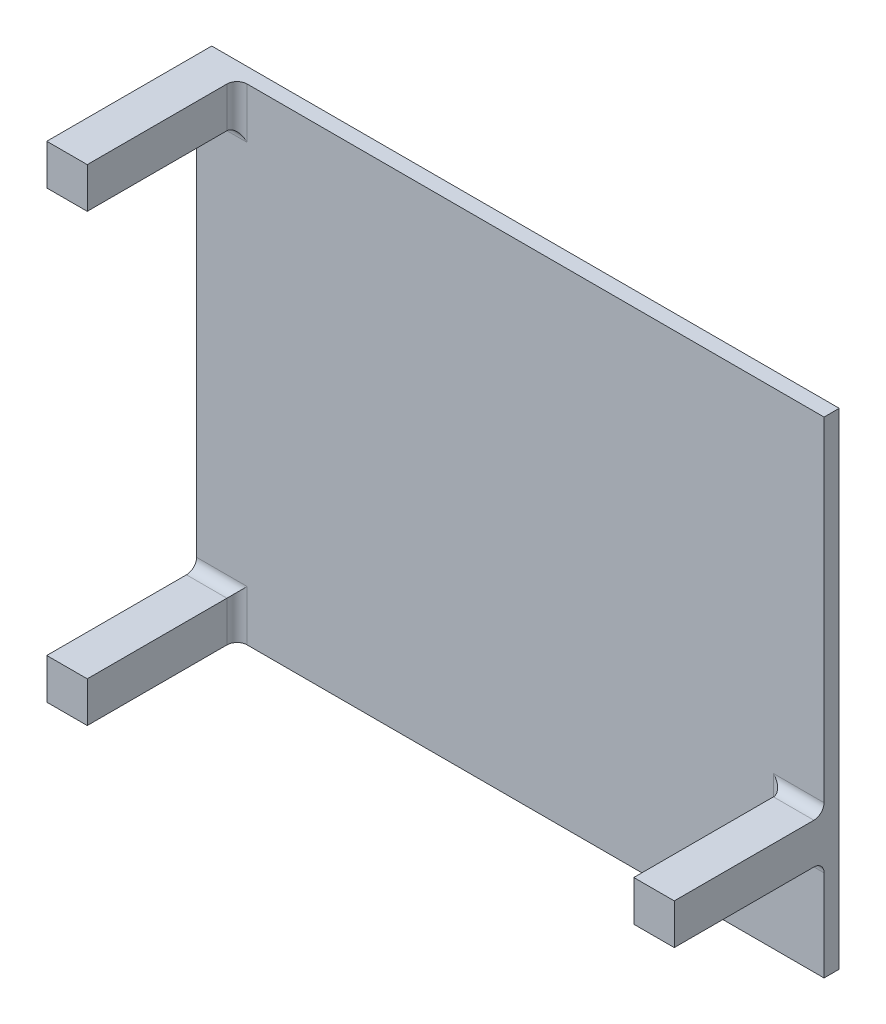
ISO-10303-21;
HEADER;
FILE_DESCRIPTION(('STEP AP214'),'2;1');
FILE_NAME('part.step','',(''),(''),'','','');
FILE_SCHEMA(('AUTOMOTIVE_DESIGN { 1 0 10303 214 1 1 1 1 }'));
ENDSEC;
DATA;
#1=APPLICATION_CONTEXT('core data for automotive mechanical design processes');
#2=APPLICATION_PROTOCOL_DEFINITION('international standard','automotive_design',2000,#1);
#3=PRODUCT_CONTEXT('',#1,'mechanical');
#4=PRODUCT('Part','Part','',(#3));
#5=PRODUCT_RELATED_PRODUCT_CATEGORY('part','',(#4));
#6=PRODUCT_DEFINITION_FORMATION('','',#4);
#7=PRODUCT_DEFINITION_CONTEXT('part definition',#1,'design');
#8=PRODUCT_DEFINITION('design','',#6,#7);
#9=PRODUCT_DEFINITION_SHAPE('','',#8);
#10=(LENGTH_UNIT() NAMED_UNIT(*) SI_UNIT(.MILLI.,.METRE.));
#11=(NAMED_UNIT(*) PLANE_ANGLE_UNIT() SI_UNIT($,.RADIAN.));
#12=(NAMED_UNIT(*) SI_UNIT($,.STERADIAN.) SOLID_ANGLE_UNIT());
#13=UNCERTAINTY_MEASURE_WITH_UNIT(LENGTH_MEASURE(1.E-05),#10,'distance_accuracy_value','');
#14=(GEOMETRIC_REPRESENTATION_CONTEXT(3) GLOBAL_UNCERTAINTY_ASSIGNED_CONTEXT((#13)) GLOBAL_UNIT_ASSIGNED_CONTEXT((#10,
#11,#12)) REPRESENTATION_CONTEXT('',''));
#15=CARTESIAN_POINT('',(0.,0.,0.));
#16=DIRECTION('',(0.,0.,1.));
#17=DIRECTION('',(1.,0.,0.));
#18=AXIS2_PLACEMENT_3D('',#15,#16,#17);
#19=CARTESIAN_POINT('',(0.,0.,1.5));
#20=DIRECTION('',(0.,0.,1.));
#21=DIRECTION('',(1.,0.,0.));
#22=AXIS2_PLACEMENT_3D('',#19,#20,#21);
#23=PLANE('',#22);
#24=DIRECTION('',(0.,-1.,0.));
#25=VECTOR('',#24,1.);
#26=CARTESIAN_POINT('',(17.5663865007572,0.,1.5));
#27=LINE('',#26,#25);
#28=CARTESIAN_POINT('',(17.5663865007572,-9.92335766423358,1.5));
#29=VERTEX_POINT('',#28);
#30=CARTESIAN_POINT('',(17.5663865007572,-3.92335766423359,1.5));
#31=VERTEX_POINT('',#30);
#32=EDGE_CURVE('E279',#29,#31,#27,.F.);
#33=ORIENTED_EDGE('',*,*,#32,.T.);
#34=DIRECTION('',(-1.,0.,0.));
#35=VECTOR('',#34,1.);
#36=CARTESIAN_POINT('',(0.,-3.92335766423359,1.5));
#37=LINE('',#36,#35);
#38=CARTESIAN_POINT('',(22.5663865007572,-3.92335766423359,1.5));
#39=VERTEX_POINT('',#38);
#40=EDGE_CURVE('E281',#31,#39,#37,.F.);
#41=ORIENTED_EDGE('',*,*,#40,.T.);
#42=DIRECTION('',(0.,1.,0.));
#43=VECTOR('',#42,1.);
#44=CARTESIAN_POINT('',(22.5663865007572,29.0766423357664,1.5));
#45=LINE('',#44,#43);
#46=CARTESIAN_POINT('',(22.5663865007572,29.0766423357664,1.5));
#47=VERTEX_POINT('',#46);
#48=EDGE_CURVE('E241',#39,#47,#45,.T.);
#49=ORIENTED_EDGE('',*,*,#48,.T.);
#50=DIRECTION('',(-1.,0.,0.));
#51=VECTOR('',#50,1.);
#52=CARTESIAN_POINT('',(-39.4336134992428,29.0766423357664,1.5));
#53=LINE('',#52,#51);
#54=CARTESIAN_POINT('',(-34.4336134992428,29.0766423357664,1.5));
#55=VERTEX_POINT('',#54);
#56=EDGE_CURVE('E245',#47,#55,#53,.T.);
#57=ORIENTED_EDGE('',*,*,#56,.T.);
#58=DIRECTION('',(0.,1.,0.));
#59=VECTOR('',#58,1.);
#60=CARTESIAN_POINT('',(-34.4336134992428,0.,1.5));
#61=LINE('',#60,#59);
#62=CARTESIAN_POINT('',(-34.4336134992428,24.0766423357664,1.5));
#63=VERTEX_POINT('',#62);
#64=EDGE_CURVE('E273',#55,#63,#61,.F.);
#65=ORIENTED_EDGE('',*,*,#64,.T.);
#66=DIRECTION('',(1.,0.,0.));
#67=VECTOR('',#66,1.);
#68=CARTESIAN_POINT('',(0.,24.0766423357664,1.5));
#69=LINE('',#68,#67);
#70=CARTESIAN_POINT('',(-39.4336134992428,24.0766423357664,1.5));
#71=VERTEX_POINT('',#70);
#72=EDGE_CURVE('E275',#63,#71,#69,.F.);
#73=ORIENTED_EDGE('',*,*,#72,.T.);
#74=DIRECTION('',(0.,-1.,0.));
#75=VECTOR('',#74,1.);
#76=CARTESIAN_POINT('',(-39.4336134992428,29.0766423357664,1.5));
#77=LINE('',#76,#75);
#78=CARTESIAN_POINT('',(-39.4336134992428,-13.9233576642336,1.5));
#79=VERTEX_POINT('',#78);
#80=EDGE_CURVE('E235',#71,#79,#77,.T.);
#81=ORIENTED_EDGE('',*,*,#80,.T.);
#82=DIRECTION('',(-1.,0.,0.));
#83=VECTOR('',#82,1.);
#84=CARTESIAN_POINT('',(0.,-13.9233576642336,1.5));
#85=LINE('',#84,#83);
#86=CARTESIAN_POINT('',(-34.4336134992428,-13.9233576642336,1.5));
#87=VERTEX_POINT('',#86);
#88=EDGE_CURVE('E269',#79,#87,#85,.F.);
#89=ORIENTED_EDGE('',*,*,#88,.T.);
#90=DIRECTION('',(0.,1.,0.));
#91=VECTOR('',#90,1.);
#92=CARTESIAN_POINT('',(-34.4336134992428,0.,1.5));
#93=LINE('',#92,#91);
#94=CARTESIAN_POINT('',(-34.4336134992428,-18.9233576642336,1.5));
#95=VERTEX_POINT('',#94);
#96=EDGE_CURVE('E271',#87,#95,#93,.F.);
#97=ORIENTED_EDGE('',*,*,#96,.T.);
#98=DIRECTION('',(1.,0.,0.));
#99=VECTOR('',#98,1.);
#100=CARTESIAN_POINT('',(-39.4336134992428,-18.9233576642336,1.5));
#101=LINE('',#100,#99);
#102=CARTESIAN_POINT('',(22.5663865007572,-18.9233576642336,1.5));
#103=VERTEX_POINT('',#102);
#104=EDGE_CURVE('E238',#95,#103,#101,.T.);
#105=ORIENTED_EDGE('',*,*,#104,.T.);
#106=CARTESIAN_POINT('',(22.5663865007572,-9.92335766423358,1.5));
#107=VERTEX_POINT('',#106);
#108=EDGE_CURVE('E242',#103,#107,#45,.T.);
#109=ORIENTED_EDGE('',*,*,#108,.T.);
#110=DIRECTION('',(1.,0.,0.));
#111=VECTOR('',#110,1.);
#112=CARTESIAN_POINT('',(0.,-9.92335766423358,1.5));
#113=LINE('',#112,#111);
#114=EDGE_CURVE('E277',#107,#29,#113,.F.);
#115=ORIENTED_EDGE('',*,*,#114,.T.);
#116=EDGE_LOOP('',(#33,#41,#49,#57,#65,#73,#81,#89,#97,#105,#109,#115));
#117=FACE_BOUND('',#116,.T.);
#118=ADVANCED_FACE('F33',(#117),#23,.T.);
#119=CARTESIAN_POINT('',(-39.4336134992428,29.0766423357664,1.5));
#120=DIRECTION('',(1.,0.,0.));
#121=DIRECTION('',(0.,1.,0.));
#122=AXIS2_PLACEMENT_3D('',#119,#120,#121);
#123=PLANE('',#122);
#124=DIRECTION('',(0.,-1.,0.));
#125=VECTOR('',#124,1.);
#126=CARTESIAN_POINT('',(-39.4336134992428,29.0766423357664,0.));
#127=LINE('',#126,#125);
#128=CARTESIAN_POINT('',(-39.4336134992428,29.0766423357664,0.));
#129=VERTEX_POINT('',#128);
#130=CARTESIAN_POINT('',(-39.4336134992428,-18.9233576642336,0.));
#131=VERTEX_POINT('',#130);
#132=EDGE_CURVE('E234',#129,#131,#127,.T.);
#133=ORIENTED_EDGE('',*,*,#132,.T.);
#134=DIRECTION('',(0.,0.,-1.));
#135=VECTOR('',#134,1.);
#136=CARTESIAN_POINT('',(-39.4336134992428,-18.9233576642336,1.5));
#137=LINE('',#136,#135);
#138=CARTESIAN_POINT('',(-39.4336134992428,-18.9233576642336,16.3));
#139=VERTEX_POINT('',#138);
#140=EDGE_CURVE('E264',#139,#131,#137,.T.);
#141=ORIENTED_EDGE('',*,*,#140,.F.);
#142=DIRECTION('',(0.,-1.,0.));
#143=VECTOR('',#142,1.);
#144=CARTESIAN_POINT('',(-39.4336134992428,-14.9233576642336,16.3));
#145=LINE('',#144,#143);
#146=CARTESIAN_POINT('',(-39.4336134992428,-14.9233576642336,16.3));
#147=VERTEX_POINT('',#146);
#148=EDGE_CURVE('E195',#147,#139,#145,.T.);
#149=ORIENTED_EDGE('',*,*,#148,.F.);
#150=DIRECTION('',(0.,0.,-1.));
#151=VECTOR('',#150,1.);
#152=CARTESIAN_POINT('',(-39.4336134992428,-14.9233576642336,16.3));
#153=LINE('',#152,#151);
#154=CARTESIAN_POINT('',(-39.4336134992428,-14.9233576642336,2.5));
#155=VERTEX_POINT('',#154);
#156=EDGE_CURVE('E209',#147,#155,#153,.T.);
#157=ORIENTED_EDGE('',*,*,#156,.T.);
#158=CARTESIAN_POINT('',(-39.4336134992428,-13.9233576642336,2.5));
#159=DIRECTION('',(1.,0.,0.));
#160=DIRECTION('',(0.,1.,0.));
#161=AXIS2_PLACEMENT_3D('',#158,#159,#160);
#162=CIRCLE('',#161,1.);
#163=EDGE_CURVE('E11',#155,#79,#162,.T.);
#164=ORIENTED_EDGE('',*,*,#163,.T.);
#165=ORIENTED_EDGE('',*,*,#80,.F.);
#166=CARTESIAN_POINT('',(-39.4336134992428,24.0766423357664,2.5));
#167=DIRECTION('',(1.,0.,0.));
#168=DIRECTION('',(0.,1.,0.));
#169=AXIS2_PLACEMENT_3D('',#166,#167,#168);
#170=CIRCLE('',#169,1.);
#171=CARTESIAN_POINT('',(-39.4336134992428,25.0766423357664,2.5));
#172=VERTEX_POINT('',#171);
#173=EDGE_CURVE('E299',#71,#172,#170,.T.);
#174=ORIENTED_EDGE('',*,*,#173,.T.);
#175=DIRECTION('',(0.,0.,-1.));
#176=VECTOR('',#175,1.);
#177=CARTESIAN_POINT('',(-39.4336134992428,25.0766423357664,16.3));
#178=LINE('',#177,#176);
#179=CARTESIAN_POINT('',(-39.4336134992428,25.0766423357664,16.3));
#180=VERTEX_POINT('',#179);
#181=EDGE_CURVE('E231',#180,#172,#178,.T.);
#182=ORIENTED_EDGE('',*,*,#181,.F.);
#183=DIRECTION('',(0.,-1.,0.));
#184=VECTOR('',#183,1.);
#185=CARTESIAN_POINT('',(-39.4336134992428,29.0766423357664,16.3));
#186=LINE('',#185,#184);
#187=CARTESIAN_POINT('',(-39.4336134992428,29.0766423357664,16.3));
#188=VERTEX_POINT('',#187);
#189=EDGE_CURVE('E215',#188,#180,#186,.T.);
#190=ORIENTED_EDGE('',*,*,#189,.F.);
#191=DIRECTION('',(0.,0.,-1.));
#192=VECTOR('',#191,1.);
#193=CARTESIAN_POINT('',(-39.4336134992428,29.0766423357664,1.5));
#194=LINE('',#193,#192);
#195=EDGE_CURVE('E248',#188,#129,#194,.T.);
#196=ORIENTED_EDGE('',*,*,#195,.T.);
#197=EDGE_LOOP('',(#133,#141,#149,#157,#164,#165,#174,#182,#190,#196));
#198=FACE_BOUND('',#197,.T.);
#199=ADVANCED_FACE('F334',(#198),#123,.F.);
#200=CARTESIAN_POINT('',(-39.4336134992428,-18.9233576642336,1.5));
#201=DIRECTION('',(0.,1.,0.));
#202=DIRECTION('',(0.,0.,1.));
#203=AXIS2_PLACEMENT_3D('',#200,#201,#202);
#204=PLANE('',#203);
#205=DIRECTION('',(1.,0.,0.));
#206=VECTOR('',#205,1.);
#207=CARTESIAN_POINT('',(-39.4336134992428,-18.9233576642336,0.));
#208=LINE('',#207,#206);
#209=CARTESIAN_POINT('',(22.5663865007572,-18.9233576642336,0.));
#210=VERTEX_POINT('',#209);
#211=EDGE_CURVE('E251',#131,#210,#208,.T.);
#212=ORIENTED_EDGE('',*,*,#211,.T.);
#213=DIRECTION('',(0.,0.,-1.));
#214=VECTOR('',#213,1.);
#215=CARTESIAN_POINT('',(22.5663865007572,-18.9233576642336,1.5));
#216=LINE('',#215,#214);
#217=EDGE_CURVE('E261',#103,#210,#216,.T.);
#218=ORIENTED_EDGE('',*,*,#217,.F.);
#219=ORIENTED_EDGE('',*,*,#104,.F.);
#220=CARTESIAN_POINT('',(-34.4336134992428,-18.9233576642336,2.5));
#221=DIRECTION('',(0.,1.,0.));
#222=DIRECTION('',(0.,0.,1.));
#223=AXIS2_PLACEMENT_3D('',#220,#221,#222);
#224=CIRCLE('',#223,1.);
#225=CARTESIAN_POINT('',(-35.4336134992428,-18.9233576642336,2.5));
#226=VERTEX_POINT('',#225);
#227=EDGE_CURVE('E42',#95,#226,#224,.T.);
#228=ORIENTED_EDGE('',*,*,#227,.T.);
#229=DIRECTION('',(0.,0.,-1.));
#230=VECTOR('',#229,1.);
#231=CARTESIAN_POINT('',(-35.4336134992428,-18.9233576642336,16.3));
#232=LINE('',#231,#230);
#233=CARTESIAN_POINT('',(-35.4336134992428,-18.9233576642336,16.3));
#234=VERTEX_POINT('',#233);
#235=EDGE_CURVE('E213',#234,#226,#232,.T.);
#236=ORIENTED_EDGE('',*,*,#235,.F.);
#237=DIRECTION('',(1.,0.,0.));
#238=VECTOR('',#237,1.);
#239=CARTESIAN_POINT('',(-39.4336134992428,-18.9233576642336,16.3));
#240=LINE('',#239,#238);
#241=EDGE_CURVE('E198',#139,#234,#240,.T.);
#242=ORIENTED_EDGE('',*,*,#241,.F.);
#243=ORIENTED_EDGE('',*,*,#140,.T.);
#244=EDGE_LOOP('',(#212,#218,#219,#228,#236,#242,#243));
#245=FACE_BOUND('',#244,.T.);
#246=ADVANCED_FACE('F331',(#245),#204,.F.);
#247=CARTESIAN_POINT('',(22.5663865007572,29.0766423357664,1.5));
#248=DIRECTION('',(-1.,0.,0.));
#249=DIRECTION('',(0.,-1.,0.));
#250=AXIS2_PLACEMENT_3D('',#247,#248,#249);
#251=PLANE('',#250);
#252=DIRECTION('',(0.,1.,0.));
#253=VECTOR('',#252,1.);
#254=CARTESIAN_POINT('',(22.5663865007572,29.0766423357664,0.));
#255=LINE('',#254,#253);
#256=CARTESIAN_POINT('',(22.5663865007572,29.0766423357664,0.));
#257=VERTEX_POINT('',#256);
#258=EDGE_CURVE('E253',#210,#257,#255,.T.);
#259=ORIENTED_EDGE('',*,*,#258,.T.);
#260=DIRECTION('',(0.,0.,-1.));
#261=VECTOR('',#260,1.);
#262=CARTESIAN_POINT('',(22.5663865007572,29.0766423357664,1.5));
#263=LINE('',#262,#261);
#264=EDGE_CURVE('E258',#47,#257,#263,.T.);
#265=ORIENTED_EDGE('',*,*,#264,.F.);
#266=ORIENTED_EDGE('',*,*,#48,.F.);
#267=CARTESIAN_POINT('',(22.5663865007572,-3.92335766423359,2.5));
#268=DIRECTION('',(-1.,0.,0.));
#269=DIRECTION('',(0.,-1.,0.));
#270=AXIS2_PLACEMENT_3D('',#267,#268,#269);
#271=CIRCLE('',#270,1.);
#272=CARTESIAN_POINT('',(22.5663865007572,-4.92335766423359,2.5));
#273=VERTEX_POINT('',#272);
#274=EDGE_CURVE('E194',#39,#273,#271,.T.);
#275=ORIENTED_EDGE('',*,*,#274,.T.);
#276=DIRECTION('',(0.,0.,-1.));
#277=VECTOR('',#276,1.);
#278=CARTESIAN_POINT('',(22.5663865007572,-4.92335766423359,16.3));
#279=LINE('',#278,#277);
#280=CARTESIAN_POINT('',(22.5663865007572,-4.92335766423359,16.3));
#281=VERTEX_POINT('',#280);
#282=EDGE_CURVE('E173',#281,#273,#279,.T.);
#283=ORIENTED_EDGE('',*,*,#282,.F.);
#284=DIRECTION('',(0.,1.,0.));
#285=VECTOR('',#284,1.);
#286=CARTESIAN_POINT('',(22.5663865007572,-4.92335766423359,16.3));
#287=LINE('',#286,#285);
#288=CARTESIAN_POINT('',(22.5663865007572,-8.92335766423359,16.3));
#289=VERTEX_POINT('',#288);
#290=EDGE_CURVE('E180',#289,#281,#287,.T.);
#291=ORIENTED_EDGE('',*,*,#290,.F.);
#292=DIRECTION('',(0.,0.,-1.));
#293=VECTOR('',#292,1.);
#294=CARTESIAN_POINT('',(22.5663865007572,-8.92335766423359,16.3));
#295=LINE('',#294,#293);
#296=CARTESIAN_POINT('',(22.5663865007572,-8.92335766423359,2.5));
#297=VERTEX_POINT('',#296);
#298=EDGE_CURVE('E404',#289,#297,#295,.T.);
#299=ORIENTED_EDGE('',*,*,#298,.T.);
#300=CARTESIAN_POINT('',(22.5663865007572,-9.92335766423358,2.5));
#301=DIRECTION('',(-1.,0.,0.));
#302=DIRECTION('',(0.,-1.,0.));
#303=AXIS2_PLACEMENT_3D('',#300,#301,#302);
#304=CIRCLE('',#303,1.);
#305=EDGE_CURVE('E297',#297,#107,#304,.T.);
#306=ORIENTED_EDGE('',*,*,#305,.T.);
#307=ORIENTED_EDGE('',*,*,#108,.F.);
#308=ORIENTED_EDGE('',*,*,#217,.T.);
#309=EDGE_LOOP('',(#259,#265,#266,#275,#283,#291,#299,#306,#307,#308));
#310=FACE_BOUND('',#309,.T.);
#311=ADVANCED_FACE('F191',(#310),#251,.F.);
#312=CARTESIAN_POINT('',(-39.4336134992428,29.0766423357664,1.5));
#313=DIRECTION('',(0.,-1.,0.));
#314=DIRECTION('',(0.,0.,-1.));
#315=AXIS2_PLACEMENT_3D('',#312,#313,#314);
#316=PLANE('',#315);
#317=DIRECTION('',(-1.,0.,0.));
#318=VECTOR('',#317,1.);
#319=CARTESIAN_POINT('',(-39.4336134992428,29.0766423357664,0.));
#320=LINE('',#319,#318);
#321=EDGE_CURVE('E239',#257,#129,#320,.T.);
#322=ORIENTED_EDGE('',*,*,#321,.T.);
#323=ORIENTED_EDGE('',*,*,#195,.F.);
#324=DIRECTION('',(-1.,0.,0.));
#325=VECTOR('',#324,1.);
#326=CARTESIAN_POINT('',(-39.4336134992428,29.0766423357664,16.3));
#327=LINE('',#326,#325);
#328=CARTESIAN_POINT('',(-35.4336134992428,29.0766423357664,16.3));
#329=VERTEX_POINT('',#328);
#330=EDGE_CURVE('E222',#329,#188,#327,.T.);
#331=ORIENTED_EDGE('',*,*,#330,.F.);
#332=DIRECTION('',(0.,0.,-1.));
#333=VECTOR('',#332,1.);
#334=CARTESIAN_POINT('',(-35.4336134992428,29.0766423357664,16.3));
#335=LINE('',#334,#333);
#336=CARTESIAN_POINT('',(-35.4336134992428,29.0766423357664,2.5));
#337=VERTEX_POINT('',#336);
#338=EDGE_CURVE('E225',#329,#337,#335,.T.);
#339=ORIENTED_EDGE('',*,*,#338,.T.);
#340=CARTESIAN_POINT('',(-34.4336134992428,29.0766423357664,2.5));
#341=DIRECTION('',(0.,-1.,0.));
#342=DIRECTION('',(0.,0.,-1.));
#343=AXIS2_PLACEMENT_3D('',#340,#341,#342);
#344=CIRCLE('',#343,1.);
#345=EDGE_CURVE('E301',#337,#55,#344,.T.);
#346=ORIENTED_EDGE('',*,*,#345,.T.);
#347=ORIENTED_EDGE('',*,*,#56,.F.);
#348=ORIENTED_EDGE('',*,*,#264,.T.);
#349=EDGE_LOOP('',(#322,#323,#331,#339,#346,#347,#348));
#350=FACE_BOUND('',#349,.T.);
#351=ADVANCED_FACE('F340',(#350),#316,.F.);
#352=CARTESIAN_POINT('',(0.,0.,0.));
#353=DIRECTION('',(0.,0.,1.));
#354=DIRECTION('',(1.,0.,0.));
#355=AXIS2_PLACEMENT_3D('',#352,#353,#354);
#356=PLANE('',#355);
#357=ORIENTED_EDGE('',*,*,#132,.F.);
#358=ORIENTED_EDGE('',*,*,#321,.F.);
#359=ORIENTED_EDGE('',*,*,#258,.F.);
#360=ORIENTED_EDGE('',*,*,#211,.F.);
#361=EDGE_LOOP('',(#357,#358,#359,#360));
#362=FACE_BOUND('',#361,.T.);
#363=ADVANCED_FACE('F353',(#362),#356,.F.);
#364=CARTESIAN_POINT('',(-39.4336134992428,25.0766423357664,16.3));
#365=DIRECTION('',(0.,1.,0.));
#366=DIRECTION('',(0.,0.,1.));
#367=AXIS2_PLACEMENT_3D('',#364,#365,#366);
#368=PLANE('',#367);
#369=ORIENTED_EDGE('',*,*,#181,.T.);
#370=DIRECTION('',(1.,0.,0.));
#371=VECTOR('',#370,1.);
#372=CARTESIAN_POINT('',(-39.4336134992428,25.0766423357664,2.5));
#373=LINE('',#372,#371);
#374=CARTESIAN_POINT('',(-35.4336134992428,25.0766423357664,2.5));
#375=VERTEX_POINT('',#374);
#376=EDGE_CURVE('E287',#172,#375,#373,.T.);
#377=ORIENTED_EDGE('',*,*,#376,.T.);
#378=DIRECTION('',(0.,0.,-1.));
#379=VECTOR('',#378,1.);
#380=CARTESIAN_POINT('',(-35.4336134992428,25.0766423357664,16.3));
#381=LINE('',#380,#379);
#382=CARTESIAN_POINT('',(-35.4336134992428,25.0766423357664,16.3));
#383=VERTEX_POINT('',#382);
#384=EDGE_CURVE('E228',#383,#375,#381,.T.);
#385=ORIENTED_EDGE('',*,*,#384,.F.);
#386=DIRECTION('',(1.,0.,0.));
#387=VECTOR('',#386,1.);
#388=CARTESIAN_POINT('',(-39.4336134992428,25.0766423357664,16.3));
#389=LINE('',#388,#387);
#390=EDGE_CURVE('E218',#180,#383,#389,.T.);
#391=ORIENTED_EDGE('',*,*,#390,.F.);
#392=EDGE_LOOP('',(#369,#377,#385,#391));
#393=FACE_BOUND('',#392,.T.);
#394=ADVANCED_FACE('F351',(#393),#368,.F.);
#395=CARTESIAN_POINT('',(-35.4336134992428,29.0766423357664,16.3));
#396=DIRECTION('',(-1.,0.,0.));
#397=DIRECTION('',(0.,0.,1.));
#398=AXIS2_PLACEMENT_3D('',#395,#396,#397);
#399=PLANE('',#398);
#400=ORIENTED_EDGE('',*,*,#384,.T.);
#401=DIRECTION('',(0.,1.,0.));
#402=VECTOR('',#401,1.);
#403=CARTESIAN_POINT('',(-35.4336134992428,29.0766423357664,2.5));
#404=LINE('',#403,#402);
#405=EDGE_CURVE('E290',#375,#337,#404,.T.);
#406=ORIENTED_EDGE('',*,*,#405,.T.);
#407=ORIENTED_EDGE('',*,*,#338,.F.);
#408=DIRECTION('',(0.,1.,0.));
#409=VECTOR('',#408,1.);
#410=CARTESIAN_POINT('',(-35.4336134992428,29.0766423357664,16.3));
#411=LINE('',#410,#409);
#412=EDGE_CURVE('E220',#383,#329,#411,.T.);
#413=ORIENTED_EDGE('',*,*,#412,.F.);
#414=EDGE_LOOP('',(#400,#406,#407,#413));
#415=FACE_BOUND('',#414,.T.);
#416=ADVANCED_FACE('F381',(#415),#399,.F.);
#417=CARTESIAN_POINT('',(0.,0.,16.3));
#418=DIRECTION('',(0.,0.,1.));
#419=DIRECTION('',(1.,0.,0.));
#420=AXIS2_PLACEMENT_3D('',#417,#418,#419);
#421=PLANE('',#420);
#422=ORIENTED_EDGE('',*,*,#189,.T.);
#423=ORIENTED_EDGE('',*,*,#390,.T.);
#424=ORIENTED_EDGE('',*,*,#412,.T.);
#425=ORIENTED_EDGE('',*,*,#330,.T.);
#426=EDGE_LOOP('',(#422,#423,#424,#425));
#427=FACE_BOUND('',#426,.T.);
#428=ADVANCED_FACE('F383',(#427),#421,.T.);
#429=CARTESIAN_POINT('',(-35.4336134992428,-14.9233576642336,16.3));
#430=DIRECTION('',(-1.,0.,0.));
#431=DIRECTION('',(0.,0.,1.));
#432=AXIS2_PLACEMENT_3D('',#429,#430,#431);
#433=PLANE('',#432);
#434=ORIENTED_EDGE('',*,*,#235,.T.);
#435=DIRECTION('',(0.,1.,0.));
#436=VECTOR('',#435,1.);
#437=CARTESIAN_POINT('',(-35.4336134992428,-14.9233576642336,2.5));
#438=LINE('',#437,#436);
#439=CARTESIAN_POINT('',(-35.4336134992428,-14.9233576642336,2.5));
#440=VERTEX_POINT('',#439);
#441=EDGE_CURVE('E292',#226,#440,#438,.T.);
#442=ORIENTED_EDGE('',*,*,#441,.T.);
#443=DIRECTION('',(0.,0.,-1.));
#444=VECTOR('',#443,1.);
#445=CARTESIAN_POINT('',(-35.4336134992428,-14.9233576642336,16.3));
#446=LINE('',#445,#444);
#447=CARTESIAN_POINT('',(-35.4336134992428,-14.9233576642336,16.3));
#448=VERTEX_POINT('',#447);
#449=EDGE_CURVE('E211',#448,#440,#446,.T.);
#450=ORIENTED_EDGE('',*,*,#449,.F.);
#451=DIRECTION('',(0.,1.,0.));
#452=VECTOR('',#451,1.);
#453=CARTESIAN_POINT('',(-35.4336134992428,-14.9233576642336,16.3));
#454=LINE('',#453,#452);
#455=EDGE_CURVE('E205',#234,#448,#454,.T.);
#456=ORIENTED_EDGE('',*,*,#455,.F.);
#457=EDGE_LOOP('',(#434,#442,#450,#456));
#458=FACE_BOUND('',#457,.T.);
#459=ADVANCED_FACE('F323',(#458),#433,.F.);
#460=CARTESIAN_POINT('',(-39.4336134992428,-14.9233576642336,16.3));
#461=DIRECTION('',(0.,-1.,0.));
#462=DIRECTION('',(0.,0.,-1.));
#463=AXIS2_PLACEMENT_3D('',#460,#461,#462);
#464=PLANE('',#463);
#465=ORIENTED_EDGE('',*,*,#449,.T.);
#466=DIRECTION('',(-1.,0.,0.));
#467=VECTOR('',#466,1.);
#468=CARTESIAN_POINT('',(-39.4336134992428,-14.9233576642336,2.5));
#469=LINE('',#468,#467);
#470=EDGE_CURVE('E50',#440,#155,#469,.T.);
#471=ORIENTED_EDGE('',*,*,#470,.T.);
#472=ORIENTED_EDGE('',*,*,#156,.F.);
#473=DIRECTION('',(-1.,0.,0.));
#474=VECTOR('',#473,1.);
#475=CARTESIAN_POINT('',(-39.4336134992428,-14.9233576642336,16.3));
#476=LINE('',#475,#474);
#477=EDGE_CURVE('E207',#448,#147,#476,.T.);
#478=ORIENTED_EDGE('',*,*,#477,.F.);
#479=EDGE_LOOP('',(#465,#471,#472,#478));
#480=FACE_BOUND('',#479,.T.);
#481=ADVANCED_FACE('F326',(#480),#464,.F.);
#482=CARTESIAN_POINT('',(0.,0.,16.3));
#483=DIRECTION('',(0.,0.,1.));
#484=DIRECTION('',(1.,0.,0.));
#485=AXIS2_PLACEMENT_3D('',#482,#483,#484);
#486=PLANE('',#485);
#487=ORIENTED_EDGE('',*,*,#148,.T.);
#488=ORIENTED_EDGE('',*,*,#241,.T.);
#489=ORIENTED_EDGE('',*,*,#455,.T.);
#490=ORIENTED_EDGE('',*,*,#477,.T.);
#491=EDGE_LOOP('',(#487,#488,#489,#490));
#492=FACE_BOUND('',#491,.T.);
#493=ADVANCED_FACE('F329',(#492),#486,.T.);
#494=CARTESIAN_POINT('',(22.5663865007572,-4.92335766423359,16.3));
#495=DIRECTION('',(0.,-1.,0.));
#496=DIRECTION('',(0.,0.,-1.));
#497=AXIS2_PLACEMENT_3D('',#494,#495,#496);
#498=PLANE('',#497);
#499=ORIENTED_EDGE('',*,*,#282,.T.);
#500=DIRECTION('',(-1.,0.,0.));
#501=VECTOR('',#500,1.);
#502=CARTESIAN_POINT('',(22.5663865007572,-4.92335766423359,2.5));
#503=LINE('',#502,#501);
#504=CARTESIAN_POINT('',(18.5663865007572,-4.92335766423359,2.5));
#505=VERTEX_POINT('',#504);
#506=EDGE_CURVE('E267',#273,#505,#503,.T.);
#507=ORIENTED_EDGE('',*,*,#506,.T.);
#508=DIRECTION('',(0.,0.,-1.));
#509=VECTOR('',#508,1.);
#510=CARTESIAN_POINT('',(18.5663865007572,-4.92335766423359,16.3));
#511=LINE('',#510,#509);
#512=CARTESIAN_POINT('',(18.5663865007572,-4.92335766423359,16.3));
#513=VERTEX_POINT('',#512);
#514=EDGE_CURVE('E176',#513,#505,#511,.T.);
#515=ORIENTED_EDGE('',*,*,#514,.F.);
#516=DIRECTION('',(-1.,0.,0.));
#517=VECTOR('',#516,1.);
#518=CARTESIAN_POINT('',(22.5663865007572,-4.92335766423359,16.3));
#519=LINE('',#518,#517);
#520=EDGE_CURVE('E168',#281,#513,#519,.T.);
#521=ORIENTED_EDGE('',*,*,#520,.F.);
#522=EDGE_LOOP('',(#499,#507,#515,#521));
#523=FACE_BOUND('',#522,.T.);
#524=ADVANCED_FACE('F170',(#523),#498,.F.);
#525=CARTESIAN_POINT('',(18.5663865007572,-4.92335766423359,16.3));
#526=DIRECTION('',(1.,0.,0.));
#527=DIRECTION('',(0.,0.,-1.));
#528=AXIS2_PLACEMENT_3D('',#525,#526,#527);
#529=PLANE('',#528);
#530=ORIENTED_EDGE('',*,*,#514,.T.);
#531=DIRECTION('',(0.,-1.,0.));
#532=VECTOR('',#531,1.);
#533=CARTESIAN_POINT('',(18.5663865007572,-4.92335766423359,2.5));
#534=LINE('',#533,#532);
#535=CARTESIAN_POINT('',(18.5663865007572,-8.92335766423359,2.5));
#536=VERTEX_POINT('',#535);
#537=EDGE_CURVE('E283',#505,#536,#534,.T.);
#538=ORIENTED_EDGE('',*,*,#537,.T.);
#539=DIRECTION('',(0.,0.,-1.));
#540=VECTOR('',#539,1.);
#541=CARTESIAN_POINT('',(18.5663865007572,-8.92335766423359,16.3));
#542=LINE('',#541,#540);
#543=CARTESIAN_POINT('',(18.5663865007572,-8.92335766423359,16.3));
#544=VERTEX_POINT('',#543);
#545=EDGE_CURVE('E200',#544,#536,#542,.T.);
#546=ORIENTED_EDGE('',*,*,#545,.F.);
#547=DIRECTION('',(0.,-1.,0.));
#548=VECTOR('',#547,1.);
#549=CARTESIAN_POINT('',(18.5663865007572,-4.92335766423359,16.3));
#550=LINE('',#549,#548);
#551=EDGE_CURVE('E179',#513,#544,#550,.T.);
#552=ORIENTED_EDGE('',*,*,#551,.F.);
#553=EDGE_LOOP('',(#530,#538,#546,#552));
#554=FACE_BOUND('',#553,.T.);
#555=ADVANCED_FACE('F400',(#554),#529,.F.);
#556=CARTESIAN_POINT('',(22.5663865007572,-8.92335766423359,16.3));
#557=DIRECTION('',(0.,1.,0.));
#558=DIRECTION('',(0.,0.,1.));
#559=AXIS2_PLACEMENT_3D('',#556,#557,#558);
#560=PLANE('',#559);
#561=ORIENTED_EDGE('',*,*,#545,.T.);
#562=DIRECTION('',(1.,0.,0.));
#563=VECTOR('',#562,1.);
#564=CARTESIAN_POINT('',(22.5663865007572,-8.92335766423359,2.5));
#565=LINE('',#564,#563);
#566=EDGE_CURVE('E285',#536,#297,#565,.T.);
#567=ORIENTED_EDGE('',*,*,#566,.T.);
#568=ORIENTED_EDGE('',*,*,#298,.F.);
#569=DIRECTION('',(1.,0.,0.));
#570=VECTOR('',#569,1.);
#571=CARTESIAN_POINT('',(22.5663865007572,-8.92335766423359,16.3));
#572=LINE('',#571,#570);
#573=EDGE_CURVE('E185',#544,#289,#572,.T.);
#574=ORIENTED_EDGE('',*,*,#573,.F.);
#575=EDGE_LOOP('',(#561,#567,#568,#574));
#576=FACE_BOUND('',#575,.T.);
#577=ADVANCED_FACE('F408',(#576),#560,.F.);
#578=CARTESIAN_POINT('',(0.,0.,16.3));
#579=DIRECTION('',(0.,0.,-1.));
#580=DIRECTION('',(-1.,0.,0.));
#581=AXIS2_PLACEMENT_3D('',#578,#579,#580);
#582=PLANE('',#581);
#583=ORIENTED_EDGE('',*,*,#290,.T.);
#584=ORIENTED_EDGE('',*,*,#520,.T.);
#585=ORIENTED_EDGE('',*,*,#551,.T.);
#586=ORIENTED_EDGE('',*,*,#573,.T.);
#587=EDGE_LOOP('',(#583,#584,#585,#586));
#588=FACE_BOUND('',#587,.T.);
#589=ADVANCED_FACE('F183',(#588),#582,.F.);
#590=CARTESIAN_POINT('',(22.5663865007572,-9.92335766423358,2.5));
#591=DIRECTION('',(1.,0.,0.));
#592=DIRECTION('',(0.,0.,-1.));
#593=AXIS2_PLACEMENT_3D('',#590,#591,#592);
#594=CYLINDRICAL_SURFACE('',#593,1.);
#595=ORIENTED_EDGE('',*,*,#305,.F.);
#596=ORIENTED_EDGE('',*,*,#566,.F.);
#597=CARTESIAN_POINT('',(17.5663865007572,-9.92335766423358,2.5));
#598=DIRECTION('',(0.707106781186547,-0.707106781186547,0.));
#599=DIRECTION('',(0.707106781186547,0.707106781186547,0.));
#600=AXIS2_PLACEMENT_3D('',#597,#598,#599);
#601=ELLIPSE('',#600,1.41421356237309,1.);
#602=EDGE_CURVE('E189',#29,#536,#601,.T.);
#603=ORIENTED_EDGE('',*,*,#602,.F.);
#604=ORIENTED_EDGE('',*,*,#114,.F.);
#605=EDGE_LOOP('',(#595,#596,#603,#604));
#606=FACE_BOUND('',#605,.T.);
#607=ADVANCED_FACE('F390',(#606),#594,.F.);
#608=CARTESIAN_POINT('',(17.5663865007572,-4.92335766423359,2.5));
#609=DIRECTION('',(0.,-1.,0.));
#610=DIRECTION('',(0.,0.,-1.));
#611=AXIS2_PLACEMENT_3D('',#608,#609,#610);
#612=CYLINDRICAL_SURFACE('',#611,1.);
#613=ORIENTED_EDGE('',*,*,#602,.T.);
#614=ORIENTED_EDGE('',*,*,#537,.F.);
#615=CARTESIAN_POINT('',(17.5663865007572,-3.92335766423359,2.5));
#616=DIRECTION('',(-0.707106781186547,-0.707106781186547,0.));
#617=DIRECTION('',(0.707106781186547,-0.707106781186547,0.));
#618=AXIS2_PLACEMENT_3D('',#615,#616,#617);
#619=ELLIPSE('',#618,1.41421356237309,1.);
#620=EDGE_CURVE('E304',#31,#505,#619,.T.);
#621=ORIENTED_EDGE('',*,*,#620,.F.);
#622=ORIENTED_EDGE('',*,*,#32,.F.);
#623=EDGE_LOOP('',(#613,#614,#621,#622));
#624=FACE_BOUND('',#623,.T.);
#625=ADVANCED_FACE('F396',(#624),#612,.F.);
#626=CARTESIAN_POINT('',(22.5663865007572,-3.92335766423359,2.5));
#627=DIRECTION('',(-1.,0.,0.));
#628=DIRECTION('',(0.,0.,1.));
#629=AXIS2_PLACEMENT_3D('',#626,#627,#628);
#630=CYLINDRICAL_SURFACE('',#629,1.);
#631=ORIENTED_EDGE('',*,*,#274,.F.);
#632=ORIENTED_EDGE('',*,*,#40,.F.);
#633=ORIENTED_EDGE('',*,*,#620,.T.);
#634=ORIENTED_EDGE('',*,*,#506,.F.);
#635=EDGE_LOOP('',(#631,#632,#633,#634));
#636=FACE_BOUND('',#635,.T.);
#637=ADVANCED_FACE('F398',(#636),#630,.F.);
#638=CARTESIAN_POINT('',(-34.4336134992428,29.0766423357664,2.5));
#639=DIRECTION('',(0.,1.,0.));
#640=DIRECTION('',(0.,0.,1.));
#641=AXIS2_PLACEMENT_3D('',#638,#639,#640);
#642=CYLINDRICAL_SURFACE('',#641,1.);
#643=ORIENTED_EDGE('',*,*,#345,.F.);
#644=ORIENTED_EDGE('',*,*,#405,.F.);
#645=CARTESIAN_POINT('',(-34.4336134992428,24.0766423357664,2.5));
#646=DIRECTION('',(0.707106781186547,0.707106781186547,0.));
#647=DIRECTION('',(-0.707106781186547,0.707106781186547,0.));
#648=AXIS2_PLACEMENT_3D('',#645,#646,#647);
#649=ELLIPSE('',#648,1.41421356237309,1.);
#650=EDGE_CURVE('E306',#63,#375,#649,.T.);
#651=ORIENTED_EDGE('',*,*,#650,.F.);
#652=ORIENTED_EDGE('',*,*,#64,.F.);
#653=EDGE_LOOP('',(#643,#644,#651,#652));
#654=FACE_BOUND('',#653,.T.);
#655=ADVANCED_FACE('F375',(#654),#642,.F.);
#656=CARTESIAN_POINT('',(-39.4336134992428,24.0766423357664,2.5));
#657=DIRECTION('',(1.,0.,0.));
#658=DIRECTION('',(0.,0.,-1.));
#659=AXIS2_PLACEMENT_3D('',#656,#657,#658);
#660=CYLINDRICAL_SURFACE('',#659,1.);
#661=ORIENTED_EDGE('',*,*,#173,.F.);
#662=ORIENTED_EDGE('',*,*,#72,.F.);
#663=ORIENTED_EDGE('',*,*,#650,.T.);
#664=ORIENTED_EDGE('',*,*,#376,.F.);
#665=EDGE_LOOP('',(#661,#662,#663,#664));
#666=FACE_BOUND('',#665,.T.);
#667=ADVANCED_FACE('F372',(#666),#660,.F.);
#668=CARTESIAN_POINT('',(-39.4336134992428,-13.9233576642336,2.5));
#669=DIRECTION('',(-1.,0.,0.));
#670=DIRECTION('',(0.,0.,1.));
#671=AXIS2_PLACEMENT_3D('',#668,#669,#670);
#672=CYLINDRICAL_SURFACE('',#671,1.);
#673=ORIENTED_EDGE('',*,*,#163,.F.);
#674=ORIENTED_EDGE('',*,*,#470,.F.);
#675=CARTESIAN_POINT('',(-34.4336134992428,-13.9233576642336,2.5));
#676=DIRECTION('',(-0.707106781186547,0.707106781186547,0.));
#677=DIRECTION('',(-0.707106781186547,-0.707106781186547,0.));
#678=AXIS2_PLACEMENT_3D('',#675,#676,#677);
#679=ELLIPSE('',#678,1.41421356237309,1.);
#680=EDGE_CURVE('E37',#87,#440,#679,.T.);
#681=ORIENTED_EDGE('',*,*,#680,.F.);
#682=ORIENTED_EDGE('',*,*,#88,.F.);
#683=EDGE_LOOP('',(#673,#674,#681,#682));
#684=FACE_BOUND('',#683,.T.);
#685=ADVANCED_FACE('F35',(#684),#672,.F.);
#686=CARTESIAN_POINT('',(-34.4336134992428,-14.9233576642336,2.5));
#687=DIRECTION('',(0.,1.,0.));
#688=DIRECTION('',(0.,0.,1.));
#689=AXIS2_PLACEMENT_3D('',#686,#687,#688);
#690=CYLINDRICAL_SURFACE('',#689,1.);
#691=ORIENTED_EDGE('',*,*,#227,.F.);
#692=ORIENTED_EDGE('',*,*,#96,.F.);
#693=ORIENTED_EDGE('',*,*,#680,.T.);
#694=ORIENTED_EDGE('',*,*,#441,.F.);
#695=EDGE_LOOP('',(#691,#692,#693,#694));
#696=FACE_BOUND('',#695,.T.);
#697=ADVANCED_FACE('F317',(#696),#690,.F.);
#698=CLOSED_SHELL('',(#118,#199,#246,#311,#351,#363,#394,#416,#428,#459,#481,#493,#524,#555,
#577,#589,#607,#625,#637,#655,#667,#685,#697));
#699=MANIFOLD_SOLID_BREP('B2',#698);
#700=ADVANCED_BREP_SHAPE_REPRESENTATION('',(#18,#699),#14);
#701=SHAPE_DEFINITION_REPRESENTATION(#9,#700);
ENDSEC;
END-ISO-10303-21;
